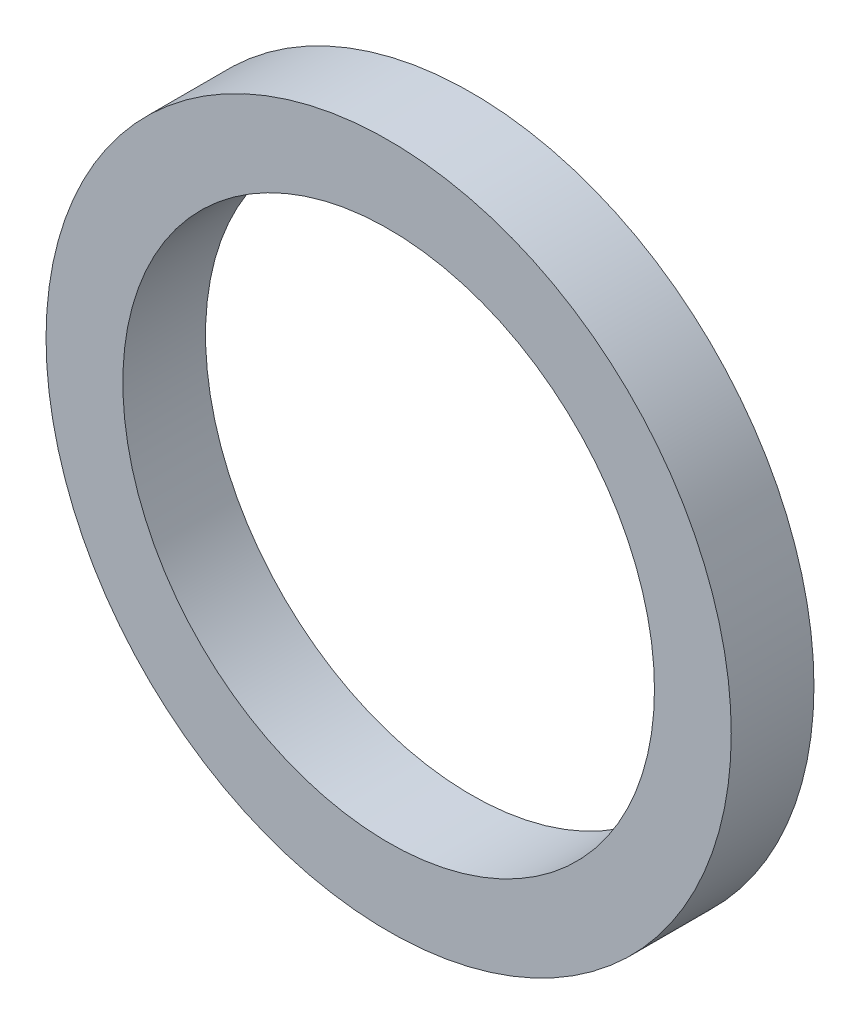
ISO-10303-21;
HEADER;
FILE_DESCRIPTION(('STEP AP214'),'2;1');
FILE_NAME('part.step','',(''),(''),'','','');
FILE_SCHEMA(('AUTOMOTIVE_DESIGN { 1 0 10303 214 1 1 1 1 }'));
ENDSEC;
DATA;
#1=APPLICATION_CONTEXT('core data for automotive mechanical design processes');
#2=APPLICATION_PROTOCOL_DEFINITION('international standard','automotive_design',2000,#1);
#3=PRODUCT_CONTEXT('',#1,'mechanical');
#4=PRODUCT('Part','Part','',(#3));
#5=PRODUCT_RELATED_PRODUCT_CATEGORY('part','',(#4));
#6=PRODUCT_DEFINITION_FORMATION('','',#4);
#7=PRODUCT_DEFINITION_CONTEXT('part definition',#1,'design');
#8=PRODUCT_DEFINITION('design','',#6,#7);
#9=PRODUCT_DEFINITION_SHAPE('','',#8);
#10=(LENGTH_UNIT() NAMED_UNIT(*) SI_UNIT(.MILLI.,.METRE.));
#11=(NAMED_UNIT(*) PLANE_ANGLE_UNIT() SI_UNIT($,.RADIAN.));
#12=(NAMED_UNIT(*) SI_UNIT($,.STERADIAN.) SOLID_ANGLE_UNIT());
#13=UNCERTAINTY_MEASURE_WITH_UNIT(LENGTH_MEASURE(1.E-05),#10,'distance_accuracy_value','');
#14=(GEOMETRIC_REPRESENTATION_CONTEXT(3) GLOBAL_UNCERTAINTY_ASSIGNED_CONTEXT((#13)) GLOBAL_UNIT_ASSIGNED_CONTEXT((#10,
#11,#12)) REPRESENTATION_CONTEXT('',''));
#15=CARTESIAN_POINT('',(0.,0.,0.));
#16=DIRECTION('',(0.,0.,1.));
#17=DIRECTION('',(1.,0.,0.));
#18=AXIS2_PLACEMENT_3D('',#15,#16,#17);
#19=CARTESIAN_POINT('',(0.,0.,3.5));
#20=DIRECTION('',(0.,0.,1.));
#21=DIRECTION('',(1.,0.,0.));
#22=AXIS2_PLACEMENT_3D('',#19,#20,#21);
#23=PLANE('',#22);
#24=CARTESIAN_POINT('',(0.,0.,3.5));
#25=DIRECTION('',(0.,0.,1.));
#26=DIRECTION('',(1.,0.,0.));
#27=AXIS2_PLACEMENT_3D('',#24,#25,#26);
#28=CIRCLE('',#27,29.);
#29=CARTESIAN_POINT('',(29.,0.,3.5));
#30=VERTEX_POINT('',#29);
#31=EDGE_CURVE('E10',#30,#30,#28,.T.);
#32=ORIENTED_EDGE('',*,*,#31,.T.);
#33=EDGE_LOOP('',(#32));
#34=FACE_BOUND('',#33,.T.);
#35=CARTESIAN_POINT('',(0.,0.,3.5));
#36=DIRECTION('',(0.,0.,1.));
#37=DIRECTION('',(1.,0.,0.));
#38=AXIS2_PLACEMENT_3D('',#35,#36,#37);
#39=CIRCLE('',#38,22.5);
#40=CARTESIAN_POINT('',(22.5,0.,3.5));
#41=VERTEX_POINT('',#40);
#42=EDGE_CURVE('E43',#41,#41,#39,.T.);
#43=ORIENTED_EDGE('',*,*,#42,.F.);
#44=EDGE_LOOP('',(#43));
#45=FACE_BOUND('',#44,.T.);
#46=ADVANCED_FACE('F32',(#34,#45),#23,.T.);
#47=CARTESIAN_POINT('',(0.,0.,-3.5));
#48=DIRECTION('',(0.,0.,1.));
#49=DIRECTION('',(1.,0.,0.));
#50=AXIS2_PLACEMENT_3D('',#47,#48,#49);
#51=PLANE('',#50);
#52=CARTESIAN_POINT('',(0.,0.,-3.5));
#53=DIRECTION('',(0.,0.,1.));
#54=DIRECTION('',(1.,0.,0.));
#55=AXIS2_PLACEMENT_3D('',#52,#53,#54);
#56=CIRCLE('',#55,29.);
#57=CARTESIAN_POINT('',(29.,0.,-3.5));
#58=VERTEX_POINT('',#57);
#59=EDGE_CURVE('E36',#58,#58,#56,.T.);
#60=ORIENTED_EDGE('',*,*,#59,.F.);
#61=EDGE_LOOP('',(#60));
#62=FACE_BOUND('',#61,.T.);
#63=CARTESIAN_POINT('',(0.,0.,-3.5));
#64=DIRECTION('',(0.,0.,1.));
#65=DIRECTION('',(1.,0.,0.));
#66=AXIS2_PLACEMENT_3D('',#63,#64,#65);
#67=CIRCLE('',#66,22.5);
#68=CARTESIAN_POINT('',(22.5,0.,-3.5));
#69=VERTEX_POINT('',#68);
#70=EDGE_CURVE('E45',#69,#69,#67,.T.);
#71=ORIENTED_EDGE('',*,*,#70,.T.);
#72=EDGE_LOOP('',(#71));
#73=FACE_BOUND('',#72,.T.);
#74=ADVANCED_FACE('F55',(#62,#73),#51,.F.);
#75=CARTESIAN_POINT('',(0.,0.,3.5));
#76=DIRECTION('',(0.,0.,-1.));
#77=DIRECTION('',(-1.,0.,0.));
#78=AXIS2_PLACEMENT_3D('',#75,#76,#77);
#79=CYLINDRICAL_SURFACE('',#78,29.);
#80=ORIENTED_EDGE('',*,*,#31,.F.);
#81=EDGE_LOOP('',(#80));
#82=FACE_BOUND('',#81,.T.);
#83=ORIENTED_EDGE('',*,*,#59,.T.);
#84=EDGE_LOOP('',(#83));
#85=FACE_BOUND('',#84,.T.);
#86=ADVANCED_FACE('F34',(#82,#85),#79,.T.);
#87=CARTESIAN_POINT('',(0.,0.,3.5));
#88=DIRECTION('',(0.,0.,-1.));
#89=DIRECTION('',(-1.,0.,0.));
#90=AXIS2_PLACEMENT_3D('',#87,#88,#89);
#91=CYLINDRICAL_SURFACE('',#90,22.5);
#92=ORIENTED_EDGE('',*,*,#42,.T.);
#93=EDGE_LOOP('',(#92));
#94=FACE_BOUND('',#93,.T.);
#95=ORIENTED_EDGE('',*,*,#70,.F.);
#96=EDGE_LOOP('',(#95));
#97=FACE_BOUND('',#96,.T.);
#98=ADVANCED_FACE('F51',(#94,#97),#91,.F.);
#99=CLOSED_SHELL('',(#46,#74,#86,#98));
#100=MANIFOLD_SOLID_BREP('B2',#99);
#101=ADVANCED_BREP_SHAPE_REPRESENTATION('',(#18,#100),#14);
#102=SHAPE_DEFINITION_REPRESENTATION(#9,#101);
ENDSEC;
END-ISO-10303-21;
